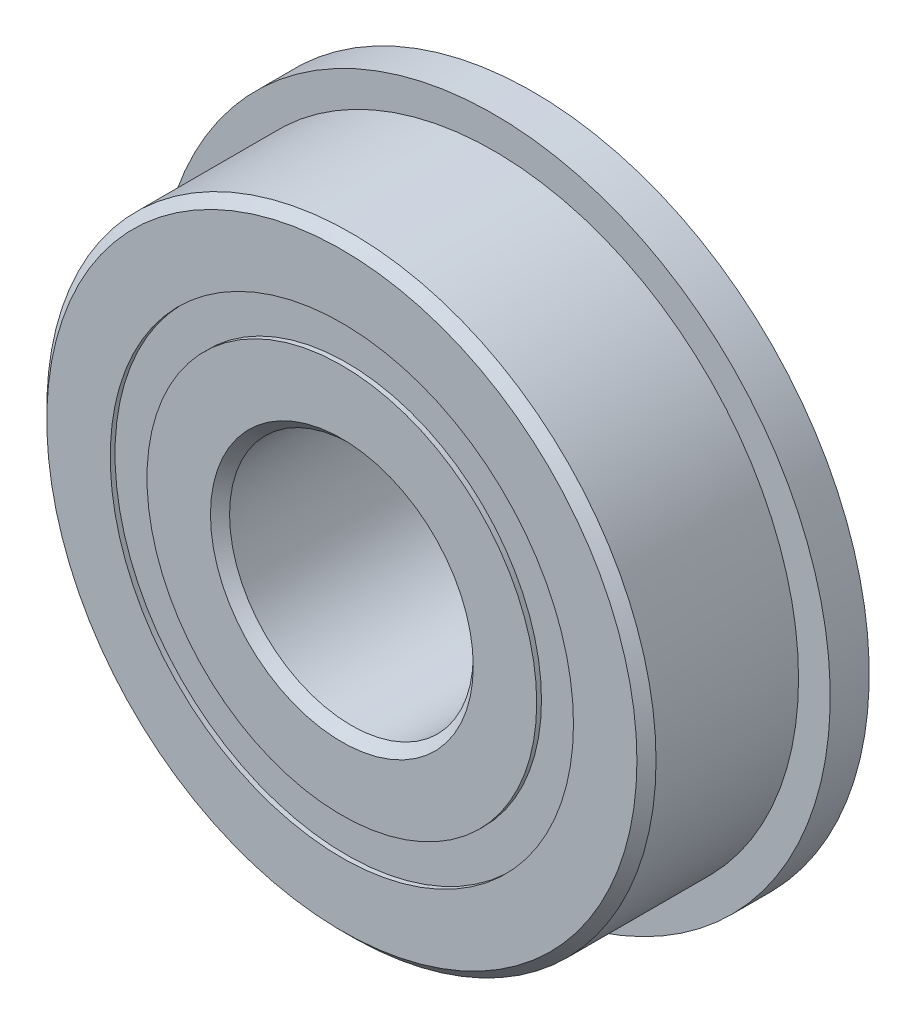
ISO-10303-21;
HEADER;
FILE_DESCRIPTION(('STEP AP214'),'2;1');
FILE_NAME('part.step','',(''),(''),'','','');
FILE_SCHEMA(('AUTOMOTIVE_DESIGN { 1 0 10303 214 1 1 1 1 }'));
ENDSEC;
DATA;
#1=APPLICATION_CONTEXT('core data for automotive mechanical design processes');
#2=APPLICATION_PROTOCOL_DEFINITION('international standard','automotive_design',2000,#1);
#3=PRODUCT_CONTEXT('',#1,'mechanical');
#4=PRODUCT('Part','Part','',(#3));
#5=PRODUCT_RELATED_PRODUCT_CATEGORY('part','',(#4));
#6=PRODUCT_DEFINITION_FORMATION('','',#4);
#7=PRODUCT_DEFINITION_CONTEXT('part definition',#1,'design');
#8=PRODUCT_DEFINITION('design','',#6,#7);
#9=PRODUCT_DEFINITION_SHAPE('','',#8);
#10=(LENGTH_UNIT() NAMED_UNIT(*) SI_UNIT(.MILLI.,.METRE.));
#11=(NAMED_UNIT(*) PLANE_ANGLE_UNIT() SI_UNIT($,.RADIAN.));
#12=(NAMED_UNIT(*) SI_UNIT($,.STERADIAN.) SOLID_ANGLE_UNIT());
#13=UNCERTAINTY_MEASURE_WITH_UNIT(LENGTH_MEASURE(1.E-05),#10,'distance_accuracy_value','');
#14=(GEOMETRIC_REPRESENTATION_CONTEXT(3) GLOBAL_UNCERTAINTY_ASSIGNED_CONTEXT((#13)) GLOBAL_UNIT_ASSIGNED_CONTEXT((#10,
#11,#12)) REPRESENTATION_CONTEXT('',''));
#15=CARTESIAN_POINT('',(0.,0.,0.));
#16=DIRECTION('',(0.,0.,1.));
#17=DIRECTION('',(1.,0.,0.));
#18=AXIS2_PLACEMENT_3D('',#15,#16,#17);
#19=CARTESIAN_POINT('',(0.,6.03522142857143,-2.36474));
#20=DIRECTION('',(0.,0.,1.));
#21=DIRECTION('',(1.,0.,0.));
#22=AXIS2_PLACEMENT_3D('',#19,#20,#21);
#23=PLANE('',#22);
#24=CARTESIAN_POINT('',(0.,0.,-2.36474));
#25=DIRECTION('',(0.,0.,1.));
#26=DIRECTION('',(1.,0.,0.));
#27=AXIS2_PLACEMENT_3D('',#24,#25,#26);
#28=CIRCLE('',#27,6.03522142857143);
#29=CARTESIAN_POINT('',(6.03522142857143,0.,-2.36474));
#30=VERTEX_POINT('',#29);
#31=EDGE_CURVE('E55',#30,#30,#28,.T.);
#32=ORIENTED_EDGE('',*,*,#31,.F.);
#33=EDGE_LOOP('',(#32));
#34=FACE_BOUND('',#33,.T.);
#35=CARTESIAN_POINT('',(0.,0.,-2.36474));
#36=DIRECTION('',(0.,0.,1.));
#37=DIRECTION('',(1.,0.,0.));
#38=AXIS2_PLACEMENT_3D('',#35,#36,#37);
#39=CIRCLE('',#38,5.07727857142857);
#40=CARTESIAN_POINT('',(5.07727857142857,0.,-2.36474));
#41=VERTEX_POINT('',#40);
#42=EDGE_CURVE('E11',#41,#41,#39,.T.);
#43=ORIENTED_EDGE('',*,*,#42,.T.);
#44=EDGE_LOOP('',(#43));
#45=FACE_BOUND('',#44,.T.);
#46=ADVANCED_FACE('F41',(#34,#45),#23,.F.);
#47=CARTESIAN_POINT('',(0.,0.,2.4892));
#48=DIRECTION('',(0.,0.,1.));
#49=DIRECTION('',(1.,0.,0.));
#50=AXIS2_PLACEMENT_3D('',#47,#48,#49);
#51=CYLINDRICAL_SURFACE('',#50,5.07727857142857);
#52=ORIENTED_EDGE('',*,*,#42,.F.);
#53=EDGE_LOOP('',(#52));
#54=FACE_BOUND('',#53,.T.);
#55=CARTESIAN_POINT('',(0.,0.,-1.20554465033679));
#56=DIRECTION('',(0.,0.,1.));
#57=DIRECTION('',(1.,0.,0.));
#58=AXIS2_PLACEMENT_3D('',#55,#56,#57);
#59=CIRCLE('',#58,5.07727857142857);
#60=CARTESIAN_POINT('',(5.07727857142857,0.,-1.20554465033679));
#61=VERTEX_POINT('',#60);
#62=EDGE_CURVE('E47',#61,#61,#59,.T.);
#63=ORIENTED_EDGE('',*,*,#62,.T.);
#64=EDGE_LOOP('',(#63));
#65=FACE_BOUND('',#64,.T.);
#66=ADVANCED_FACE('F64',(#54,#65),#51,.F.);
#67=CARTESIAN_POINT('',(0.,6.03522142857143,-1.20554465033679));
#68=DIRECTION('',(0.,0.,-1.));
#69=DIRECTION('',(-1.,0.,0.));
#70=AXIS2_PLACEMENT_3D('',#67,#68,#69);
#71=PLANE('',#70);
#72=ORIENTED_EDGE('',*,*,#62,.F.);
#73=EDGE_LOOP('',(#72));
#74=FACE_BOUND('',#73,.T.);
#75=CARTESIAN_POINT('',(0.,0.,-1.20554465033679));
#76=DIRECTION('',(0.,0.,1.));
#77=DIRECTION('',(1.,0.,0.));
#78=AXIS2_PLACEMENT_3D('',#75,#76,#77);
#79=CIRCLE('',#78,6.03522142857143);
#80=CARTESIAN_POINT('',(6.03522142857143,0.,-1.20554465033679));
#81=VERTEX_POINT('',#80);
#82=EDGE_CURVE('E51',#81,#81,#79,.T.);
#83=ORIENTED_EDGE('',*,*,#82,.T.);
#84=EDGE_LOOP('',(#83));
#85=FACE_BOUND('',#84,.T.);
#86=ADVANCED_FACE('F68',(#74,#85),#71,.F.);
#87=CARTESIAN_POINT('',(0.,0.,2.4892));
#88=DIRECTION('',(0.,0.,1.));
#89=DIRECTION('',(1.,0.,0.));
#90=AXIS2_PLACEMENT_3D('',#87,#88,#89);
#91=CYLINDRICAL_SURFACE('',#90,6.03522142857143);
#92=ORIENTED_EDGE('',*,*,#82,.F.);
#93=EDGE_LOOP('',(#92));
#94=FACE_BOUND('',#93,.T.);
#95=ORIENTED_EDGE('',*,*,#31,.T.);
#96=EDGE_LOOP('',(#95));
#97=FACE_BOUND('',#96,.T.);
#98=ADVANCED_FACE('F61',(#94,#97),#91,.T.);
#99=CLOSED_SHELL('',(#46,#66,#86,#98));
#100=MANIFOLD_SOLID_BREP('B2',#99);
#101=CARTESIAN_POINT('',(0.,6.03522142857143,2.36474));
#102=DIRECTION('',(0.,0.,-1.));
#103=DIRECTION('',(-1.,0.,0.));
#104=AXIS2_PLACEMENT_3D('',#101,#102,#103);
#105=PLANE('',#104);
#106=CARTESIAN_POINT('',(0.,0.,2.36474));
#107=DIRECTION('',(0.,0.,1.));
#108=DIRECTION('',(1.,0.,0.));
#109=AXIS2_PLACEMENT_3D('',#106,#107,#108);
#110=CIRCLE('',#109,5.07727857142857);
#111=CARTESIAN_POINT('',(5.07727857142857,0.,2.36474));
#112=VERTEX_POINT('',#111);
#113=EDGE_CURVE('E40',#112,#112,#110,.T.);
#114=ORIENTED_EDGE('',*,*,#113,.F.);
#115=EDGE_LOOP('',(#114));
#116=FACE_BOUND('',#115,.T.);
#117=CARTESIAN_POINT('',(0.,0.,2.36474));
#118=DIRECTION('',(0.,0.,1.));
#119=DIRECTION('',(1.,0.,0.));
#120=AXIS2_PLACEMENT_3D('',#117,#118,#119);
#121=CIRCLE('',#120,6.03522142857143);
#122=CARTESIAN_POINT('',(6.03522142857143,0.,2.36474));
#123=VERTEX_POINT('',#122);
#124=EDGE_CURVE('E122',#123,#123,#121,.T.);
#125=ORIENTED_EDGE('',*,*,#124,.T.);
#126=EDGE_LOOP('',(#125));
#127=FACE_BOUND('',#126,.T.);
#128=ADVANCED_FACE('F108',(#116,#127),#105,.F.);
#129=CARTESIAN_POINT('',(0.,0.,2.4892));
#130=DIRECTION('',(0.,0.,1.));
#131=DIRECTION('',(1.,0.,0.));
#132=AXIS2_PLACEMENT_3D('',#129,#130,#131);
#133=CYLINDRICAL_SURFACE('',#132,5.07727857142857);
#134=CARTESIAN_POINT('',(0.,0.,1.20554465033679));
#135=DIRECTION('',(0.,0.,1.));
#136=DIRECTION('',(1.,0.,0.));
#137=AXIS2_PLACEMENT_3D('',#134,#135,#136);
#138=CIRCLE('',#137,5.07727857142857);
#139=CARTESIAN_POINT('',(5.07727857142857,0.,1.20554465033679));
#140=VERTEX_POINT('',#139);
#141=EDGE_CURVE('E114',#140,#140,#138,.T.);
#142=ORIENTED_EDGE('',*,*,#141,.F.);
#143=EDGE_LOOP('',(#142));
#144=FACE_BOUND('',#143,.T.);
#145=ORIENTED_EDGE('',*,*,#113,.T.);
#146=EDGE_LOOP('',(#145));
#147=FACE_BOUND('',#146,.T.);
#148=ADVANCED_FACE('F137',(#144,#147),#133,.F.);
#149=CARTESIAN_POINT('',(0.,6.03522142857143,1.20554465033679));
#150=DIRECTION('',(0.,0.,1.));
#151=DIRECTION('',(1.,0.,0.));
#152=AXIS2_PLACEMENT_3D('',#149,#150,#151);
#153=PLANE('',#152);
#154=CARTESIAN_POINT('',(0.,0.,1.20554465033679));
#155=DIRECTION('',(0.,0.,1.));
#156=DIRECTION('',(1.,0.,0.));
#157=AXIS2_PLACEMENT_3D('',#154,#155,#156);
#158=CIRCLE('',#157,6.03522142857143);
#159=CARTESIAN_POINT('',(6.03522142857143,0.,1.20554465033679));
#160=VERTEX_POINT('',#159);
#161=EDGE_CURVE('E118',#160,#160,#158,.T.);
#162=ORIENTED_EDGE('',*,*,#161,.F.);
#163=EDGE_LOOP('',(#162));
#164=FACE_BOUND('',#163,.T.);
#165=ORIENTED_EDGE('',*,*,#141,.T.);
#166=EDGE_LOOP('',(#165));
#167=FACE_BOUND('',#166,.T.);
#168=ADVANCED_FACE('F132',(#164,#167),#153,.F.);
#169=CARTESIAN_POINT('',(0.,0.,2.4892));
#170=DIRECTION('',(0.,0.,1.));
#171=DIRECTION('',(1.,0.,0.));
#172=AXIS2_PLACEMENT_3D('',#169,#170,#171);
#173=CYLINDRICAL_SURFACE('',#172,6.03522142857143);
#174=ORIENTED_EDGE('',*,*,#124,.F.);
#175=EDGE_LOOP('',(#174));
#176=FACE_BOUND('',#175,.T.);
#177=ORIENTED_EDGE('',*,*,#161,.T.);
#178=EDGE_LOOP('',(#177));
#179=FACE_BOUND('',#178,.T.);
#180=ADVANCED_FACE('F129',(#176,#179),#173,.T.);
#181=CLOSED_SHELL('',(#128,#148,#168,#180));
#182=MANIFOLD_SOLID_BREP('B6',#181);
#183=CARTESIAN_POINT('',(-2.41076652547187,5.00600827228285,0.));
#184=DIRECTION('',(0.,0.,1.));
#185=DIRECTION('',(-0.433883739117546,0.900968867902425,0.));
#186=AXIS2_PLACEMENT_3D('',#183,#184,#185);
#187=SPHERICAL_SURFACE('',#186,1.20554465033679);
#188=CARTESIAN_POINT('',(-2.41076652547187,5.00600827228285,1.20554465033679));
#189=VERTEX_POINT('',#188);
#190=VERTEX_LOOP('',#189);
#191=FACE_BOUND('',#190,.T.);
#192=ADVANCED_FACE('F175',(#191),#187,.T.);
#193=CLOSED_SHELL('',(#192));
#194=MANIFOLD_SOLID_BREP('B35',#193);
#195=CARTESIAN_POINT('',(-4.34405117446295,3.46426521157764,0.));
#196=DIRECTION('',(0.,0.,1.));
#197=DIRECTION('',(-0.781831482468022,0.623489801858743,0.));
#198=AXIS2_PLACEMENT_3D('',#195,#196,#197);
#199=SPHERICAL_SURFACE('',#198,1.20554465033679);
#200=CARTESIAN_POINT('',(-4.34405117446295,3.46426521157764,1.20554465033679));
#201=VERTEX_POINT('',#200);
#202=VERTEX_LOOP('',#201);
#203=FACE_BOUND('',#202,.T.);
#204=ADVANCED_FACE('F195',(#203),#199,.T.);
#205=CLOSED_SHELL('',(#204));
#206=MANIFOLD_SOLID_BREP('B104',#205);
#207=CARTESIAN_POINT('',(-5.41694321206024,1.23638193929483,0.));
#208=DIRECTION('',(0.,0.,1.));
#209=DIRECTION('',(-0.974927912181821,0.222520933956325,0.));
#210=AXIS2_PLACEMENT_3D('',#207,#208,#209);
#211=SPHERICAL_SURFACE('',#210,1.20554465033679);
#212=CARTESIAN_POINT('',(-5.41694321206024,1.23638193929483,1.20554465033679));
#213=VERTEX_POINT('',#212);
#214=VERTEX_LOOP('',#213);
#215=FACE_BOUND('',#214,.T.);
#216=ADVANCED_FACE('F215',(#215),#211,.T.);
#217=CLOSED_SHELL('',(#216));
#218=MANIFOLD_SOLID_BREP('B171',#217);
#219=CARTESIAN_POINT('',(-5.41694321206027,-1.23638193929472,0.));
#220=DIRECTION('',(0.,0.,1.));
#221=DIRECTION('',(-0.974927912181826,-0.222520933956305,0.));
#222=AXIS2_PLACEMENT_3D('',#219,#220,#221);
#223=SPHERICAL_SURFACE('',#222,1.20554465033679);
#224=CARTESIAN_POINT('',(-5.41694321206027,-1.23638193929472,1.20554465033679));
#225=VERTEX_POINT('',#224);
#226=VERTEX_LOOP('',#225);
#227=FACE_BOUND('',#226,.T.);
#228=ADVANCED_FACE('F235',(#227),#223,.T.);
#229=CLOSED_SHELL('',(#228));
#230=MANIFOLD_SOLID_BREP('B191',#229);
#231=CARTESIAN_POINT('',(-4.34405117446302,-3.46426521157755,0.));
#232=DIRECTION('',(0.,0.,1.));
#233=DIRECTION('',(-0.781831482468035,-0.623489801858727,0.));
#234=AXIS2_PLACEMENT_3D('',#231,#232,#233);
#235=SPHERICAL_SURFACE('',#234,1.20554465033679);
#236=CARTESIAN_POINT('',(-4.34405117446302,-3.46426521157755,1.20554465033679));
#237=VERTEX_POINT('',#236);
#238=VERTEX_LOOP('',#237);
#239=FACE_BOUND('',#238,.T.);
#240=ADVANCED_FACE('F255',(#239),#235,.T.);
#241=CLOSED_SHELL('',(#240));
#242=MANIFOLD_SOLID_BREP('B211',#241);
#243=CARTESIAN_POINT('',(-2.41076652547197,-5.0060082722828,0.));
#244=DIRECTION('',(0.,0.,1.));
#245=DIRECTION('',(-0.433883739117565,-0.900968867902416,0.));
#246=AXIS2_PLACEMENT_3D('',#243,#244,#245);
#247=SPHERICAL_SURFACE('',#246,1.20554465033679);
#248=CARTESIAN_POINT('',(-2.41076652547197,-5.0060082722828,1.20554465033679));
#249=VERTEX_POINT('',#248);
#250=VERTEX_LOOP('',#249);
#251=FACE_BOUND('',#250,.T.);
#252=ADVANCED_FACE('F275',(#251),#247,.T.);
#253=CLOSED_SHELL('',(#252));
#254=MANIFOLD_SOLID_BREP('B231',#253);
#255=CARTESIAN_POINT('',(0.,-5.55625,0.));
#256=DIRECTION('',(0.,0.,1.));
#257=DIRECTION('',(0.,-1.,0.));
#258=AXIS2_PLACEMENT_3D('',#255,#256,#257);
#259=SPHERICAL_SURFACE('',#258,1.20554465033679);
#260=CARTESIAN_POINT('',(0.,-5.55625,1.20554465033679));
#261=VERTEX_POINT('',#260);
#262=VERTEX_LOOP('',#261);
#263=FACE_BOUND('',#262,.T.);
#264=ADVANCED_FACE('F295',(#263),#259,.T.);
#265=CLOSED_SHELL('',(#264));
#266=MANIFOLD_SOLID_BREP('B251',#265);
#267=CARTESIAN_POINT('',(2.4107665254719,-5.00600827228283,0.));
#268=DIRECTION('',(0.,0.,1.));
#269=DIRECTION('',(0.433883739117553,-0.900968867902422,0.));
#270=AXIS2_PLACEMENT_3D('',#267,#268,#269);
#271=SPHERICAL_SURFACE('',#270,1.20554465033679);
#272=CARTESIAN_POINT('',(2.4107665254719,-5.00600827228283,1.20554465033679));
#273=VERTEX_POINT('',#272);
#274=VERTEX_LOOP('',#273);
#275=FACE_BOUND('',#274,.T.);
#276=ADVANCED_FACE('F315',(#275),#271,.T.);
#277=CLOSED_SHELL('',(#276));
#278=MANIFOLD_SOLID_BREP('B271',#277);
#279=CARTESIAN_POINT('',(4.34405117446297,-3.46426521157761,0.));
#280=DIRECTION('',(0.,0.,1.));
#281=DIRECTION('',(0.781831482468027,-0.623489801858737,0.));
#282=AXIS2_PLACEMENT_3D('',#279,#280,#281);
#283=SPHERICAL_SURFACE('',#282,1.20554465033679);
#284=CARTESIAN_POINT('',(4.34405117446297,-3.46426521157761,1.20554465033679));
#285=VERTEX_POINT('',#284);
#286=VERTEX_LOOP('',#285);
#287=FACE_BOUND('',#286,.T.);
#288=ADVANCED_FACE('F335',(#287),#283,.T.);
#289=CLOSED_SHELL('',(#288));
#290=MANIFOLD_SOLID_BREP('B291',#289);
#291=CARTESIAN_POINT('',(5.41694321206025,-1.23638193929479,0.));
#292=DIRECTION('',(0.,0.,1.));
#293=DIRECTION('',(0.974927912181823,-0.222520933956318,0.));
#294=AXIS2_PLACEMENT_3D('',#291,#292,#293);
#295=SPHERICAL_SURFACE('',#294,1.20554465033679);
#296=CARTESIAN_POINT('',(5.41694321206025,-1.23638193929479,1.20554465033679));
#297=VERTEX_POINT('',#296);
#298=VERTEX_LOOP('',#297);
#299=FACE_BOUND('',#298,.T.);
#300=ADVANCED_FACE('F355',(#299),#295,.T.);
#301=CLOSED_SHELL('',(#300));
#302=MANIFOLD_SOLID_BREP('B311',#301);
#303=CARTESIAN_POINT('',(5.41694321206026,1.23638193929476,0.));
#304=DIRECTION('',(0.,0.,1.));
#305=DIRECTION('',(0.974927912181824,0.222520933956311,0.));
#306=AXIS2_PLACEMENT_3D('',#303,#304,#305);
#307=SPHERICAL_SURFACE('',#306,1.20554465033679);
#308=CARTESIAN_POINT('',(5.41694321206026,1.23638193929476,1.20554465033679));
#309=VERTEX_POINT('',#308);
#310=VERTEX_LOOP('',#309);
#311=FACE_BOUND('',#310,.T.);
#312=ADVANCED_FACE('F375',(#311),#307,.T.);
#313=CLOSED_SHELL('',(#312));
#314=MANIFOLD_SOLID_BREP('B331',#313);
#315=CARTESIAN_POINT('',(4.344051174463,3.46426521157758,0.));
#316=DIRECTION('',(0.,0.,1.));
#317=DIRECTION('',(0.781831482468031,0.623489801858732,0.));
#318=AXIS2_PLACEMENT_3D('',#315,#316,#317);
#319=SPHERICAL_SURFACE('',#318,1.20554465033679);
#320=CARTESIAN_POINT('',(4.344051174463,3.46426521157758,1.20554465033679));
#321=VERTEX_POINT('',#320);
#322=VERTEX_LOOP('',#321);
#323=FACE_BOUND('',#322,.T.);
#324=ADVANCED_FACE('F395',(#323),#319,.T.);
#325=CLOSED_SHELL('',(#324));
#326=MANIFOLD_SOLID_BREP('B351',#325);
#327=CARTESIAN_POINT('',(2.41076652547194,5.00600827228281,0.));
#328=DIRECTION('',(0.,0.,1.));
#329=DIRECTION('',(0.433883739117559,0.900968867902419,0.));
#330=AXIS2_PLACEMENT_3D('',#327,#328,#329);
#331=SPHERICAL_SURFACE('',#330,1.20554465033679);
#332=CARTESIAN_POINT('',(2.41076652547194,5.00600827228281,1.20554465033679));
#333=VERTEX_POINT('',#332);
#334=VERTEX_LOOP('',#333);
#335=FACE_BOUND('',#334,.T.);
#336=ADVANCED_FACE('F415',(#335),#331,.T.);
#337=CLOSED_SHELL('',(#336));
#338=MANIFOLD_SOLID_BREP('B371',#337);
#339=CARTESIAN_POINT('',(0.,5.55625,0.));
#340=DIRECTION('',(0.,0.,1.));
#341=DIRECTION('',(0.,1.,0.));
#342=AXIS2_PLACEMENT_3D('',#339,#340,#341);
#343=SPHERICAL_SURFACE('',#342,1.20554465033679);
#344=CARTESIAN_POINT('',(0.,5.55625,1.20554465033679));
#345=VERTEX_POINT('',#344);
#346=VERTEX_LOOP('',#345);
#347=FACE_BOUND('',#346,.T.);
#348=ADVANCED_FACE('F437',(#347),#343,.T.);
#349=CLOSED_SHELL('',(#348));
#350=MANIFOLD_SOLID_BREP('B391',#349);
#351=CARTESIAN_POINT('',(0.,5.07727857142857,2.4892));
#352=DIRECTION('',(0.,0.,-1.));
#353=DIRECTION('',(-1.,0.,0.));
#354=AXIS2_PLACEMENT_3D('',#351,#352,#353);
#355=PLANE('',#354);
#356=CARTESIAN_POINT('',(0.,0.,2.4892));
#357=DIRECTION('',(0.,0.,1.));
#358=DIRECTION('',(1.,0.,0.));
#359=AXIS2_PLACEMENT_3D('',#356,#357,#358);
#360=CIRCLE('',#359,3.42392);
#361=CARTESIAN_POINT('',(3.42392,0.,2.4892));
#362=VERTEX_POINT('',#361);
#363=EDGE_CURVE('E484',#362,#362,#360,.T.);
#364=ORIENTED_EDGE('',*,*,#363,.F.);
#365=EDGE_LOOP('',(#364));
#366=FACE_BOUND('',#365,.T.);
#367=CARTESIAN_POINT('',(0.,0.,2.4892));
#368=DIRECTION('',(0.,0.,1.));
#369=DIRECTION('',(1.,0.,0.));
#370=AXIS2_PLACEMENT_3D('',#367,#368,#369);
#371=CIRCLE('',#370,5.07727857142857);
#372=CARTESIAN_POINT('',(5.07727857142857,0.,2.4892));
#373=VERTEX_POINT('',#372);
#374=EDGE_CURVE('E436',#373,#373,#371,.T.);
#375=ORIENTED_EDGE('',*,*,#374,.T.);
#376=EDGE_LOOP('',(#375));
#377=FACE_BOUND('',#376,.T.);
#378=ADVANCED_FACE('F456',(#366,#377),#355,.F.);
#379=CARTESIAN_POINT('',(0.,0.,2.4892));
#380=DIRECTION('',(0.,0.,1.));
#381=DIRECTION('',(1.,0.,0.));
#382=AXIS2_PLACEMENT_3D('',#379,#380,#381);
#383=CYLINDRICAL_SURFACE('',#382,5.07727857142857);
#384=ORIENTED_EDGE('',*,*,#374,.F.);
#385=EDGE_LOOP('',(#384));
#386=FACE_BOUND('',#385,.T.);
#387=CARTESIAN_POINT('',(0.,0.,1.10631111111111));
#388=DIRECTION('',(0.,0.,1.));
#389=DIRECTION('',(1.,0.,0.));
#390=AXIS2_PLACEMENT_3D('',#387,#388,#389);
#391=CIRCLE('',#390,5.07727857142857);
#392=CARTESIAN_POINT('',(5.07727857142857,0.,1.10631111111111));
#393=VERTEX_POINT('',#392);
#394=EDGE_CURVE('E462',#393,#393,#391,.T.);
#395=ORIENTED_EDGE('',*,*,#394,.T.);
#396=EDGE_LOOP('',(#395));
#397=FACE_BOUND('',#396,.T.);
#398=ADVANCED_FACE('F491',(#386,#397),#383,.T.);
#399=CARTESIAN_POINT('',(0.,0.,0.));
#400=DIRECTION('',(0.,0.,1.));
#401=DIRECTION('',(1.,0.,0.));
#402=AXIS2_PLACEMENT_3D('',#399,#400,#401);
#403=TOROIDAL_SURFACE('',#402,5.55625,1.20554465033679);
#404=ORIENTED_EDGE('',*,*,#394,.F.);
#405=EDGE_LOOP('',(#404));
#406=FACE_BOUND('',#405,.T.);
#407=CARTESIAN_POINT('',(0.,0.,-1.10631111111111));
#408=DIRECTION('',(0.,0.,1.));
#409=DIRECTION('',(1.,0.,0.));
#410=AXIS2_PLACEMENT_3D('',#407,#408,#409);
#411=CIRCLE('',#410,5.07727857142857);
#412=CARTESIAN_POINT('',(5.07727857142857,0.,-1.10631111111111));
#413=VERTEX_POINT('',#412);
#414=EDGE_CURVE('E466',#413,#413,#411,.T.);
#415=ORIENTED_EDGE('',*,*,#414,.T.);
#416=EDGE_LOOP('',(#415));
#417=FACE_BOUND('',#416,.T.);
#418=ADVANCED_FACE('F495',(#406,#417),#403,.F.);
#419=CARTESIAN_POINT('',(0.,0.,2.4892));
#420=DIRECTION('',(0.,0.,1.));
#421=DIRECTION('',(1.,0.,0.));
#422=AXIS2_PLACEMENT_3D('',#419,#420,#421);
#423=CYLINDRICAL_SURFACE('',#422,5.07727857142857);
#424=ORIENTED_EDGE('',*,*,#414,.F.);
#425=EDGE_LOOP('',(#424));
#426=FACE_BOUND('',#425,.T.);
#427=CARTESIAN_POINT('',(0.,0.,-2.4892));
#428=DIRECTION('',(0.,0.,1.));
#429=DIRECTION('',(1.,0.,0.));
#430=AXIS2_PLACEMENT_3D('',#427,#428,#429);
#431=CIRCLE('',#430,5.07727857142857);
#432=CARTESIAN_POINT('',(5.07727857142857,0.,-2.4892));
#433=VERTEX_POINT('',#432);
#434=EDGE_CURVE('E470',#433,#433,#431,.T.);
#435=ORIENTED_EDGE('',*,*,#434,.T.);
#436=EDGE_LOOP('',(#435));
#437=FACE_BOUND('',#436,.T.);
#438=ADVANCED_FACE('F500',(#426,#437),#423,.T.);
#439=CARTESIAN_POINT('',(0.,3.42392,-2.4892));
#440=DIRECTION('',(0.,0.,1.));
#441=DIRECTION('',(1.,0.,0.));
#442=AXIS2_PLACEMENT_3D('',#439,#440,#441);
#443=PLANE('',#442);
#444=ORIENTED_EDGE('',*,*,#434,.F.);
#445=EDGE_LOOP('',(#444));
#446=FACE_BOUND('',#445,.T.);
#447=CARTESIAN_POINT('',(0.,0.,-2.4892));
#448=DIRECTION('',(0.,0.,1.));
#449=DIRECTION('',(1.,0.,0.));
#450=AXIS2_PLACEMENT_3D('',#447,#448,#449);
#451=CIRCLE('',#450,3.42392);
#452=CARTESIAN_POINT('',(3.42392,0.,-2.4892));
#453=VERTEX_POINT('',#452);
#454=EDGE_CURVE('E475',#453,#453,#451,.T.);
#455=ORIENTED_EDGE('',*,*,#454,.T.);
#456=EDGE_LOOP('',(#455));
#457=FACE_BOUND('',#456,.T.);
#458=ADVANCED_FACE('F506',(#446,#457),#443,.F.);
#459=CARTESIAN_POINT('',(0.,0.,-2.24028));
#460=DIRECTION('',(0.,0.,-1.));
#461=DIRECTION('',(-1.,0.,0.));
#462=AXIS2_PLACEMENT_3D('',#459,#460,#461);
#463=CONICAL_SURFACE('',#462,3.175,0.785398163397445);
#464=ORIENTED_EDGE('',*,*,#454,.F.);
#465=EDGE_LOOP('',(#464));
#466=FACE_BOUND('',#465,.T.);
#467=CARTESIAN_POINT('',(0.,0.,-2.24028));
#468=DIRECTION('',(0.,0.,1.));
#469=DIRECTION('',(1.,0.,0.));
#470=AXIS2_PLACEMENT_3D('',#467,#468,#469);
#471=CIRCLE('',#470,3.175);
#472=CARTESIAN_POINT('',(3.175,0.,-2.24028));
#473=VERTEX_POINT('',#472);
#474=EDGE_CURVE('E478',#473,#473,#471,.T.);
#475=ORIENTED_EDGE('',*,*,#474,.T.);
#476=EDGE_LOOP('',(#475));
#477=FACE_BOUND('',#476,.T.);
#478=ADVANCED_FACE('F510',(#466,#477),#463,.F.);
#479=CARTESIAN_POINT('',(0.,0.,2.4892));
#480=DIRECTION('',(0.,0.,1.));
#481=DIRECTION('',(1.,0.,0.));
#482=AXIS2_PLACEMENT_3D('',#479,#480,#481);
#483=CYLINDRICAL_SURFACE('',#482,3.175);
#484=ORIENTED_EDGE('',*,*,#474,.F.);
#485=EDGE_LOOP('',(#484));
#486=FACE_BOUND('',#485,.T.);
#487=CARTESIAN_POINT('',(0.,0.,2.24028));
#488=DIRECTION('',(0.,0.,1.));
#489=DIRECTION('',(1.,0.,0.));
#490=AXIS2_PLACEMENT_3D('',#487,#488,#489);
#491=CIRCLE('',#490,3.175);
#492=CARTESIAN_POINT('',(3.175,0.,2.24028));
#493=VERTEX_POINT('',#492);
#494=EDGE_CURVE('E481',#493,#493,#491,.T.);
#495=ORIENTED_EDGE('',*,*,#494,.T.);
#496=EDGE_LOOP('',(#495));
#497=FACE_BOUND('',#496,.T.);
#498=ADVANCED_FACE('F514',(#486,#497),#483,.F.);
#499=CARTESIAN_POINT('',(0.,0.,2.4892));
#500=DIRECTION('',(0.,0.,1.));
#501=DIRECTION('',(1.,0.,0.));
#502=AXIS2_PLACEMENT_3D('',#499,#500,#501);
#503=CONICAL_SURFACE('',#502,3.42392,0.785398163397452);
#504=ORIENTED_EDGE('',*,*,#494,.F.);
#505=EDGE_LOOP('',(#504));
#506=FACE_BOUND('',#505,.T.);
#507=ORIENTED_EDGE('',*,*,#363,.T.);
#508=EDGE_LOOP('',(#507));
#509=FACE_BOUND('',#508,.T.);
#510=ADVANCED_FACE('F488',(#506,#509),#503,.F.);
#511=CLOSED_SHELL('',(#378,#398,#418,#438,#458,#478,#498,#510));
#512=MANIFOLD_SOLID_BREP('B411',#511);
#513=CARTESIAN_POINT('',(0.,0.,2.24028));
#514=DIRECTION('',(0.,0.,-1.));
#515=DIRECTION('',(-1.,0.,0.));
#516=AXIS2_PLACEMENT_3D('',#513,#514,#515);
#517=CONICAL_SURFACE('',#516,7.9375,0.785398163397447);
#518=CARTESIAN_POINT('',(0.,0.,2.4892));
#519=DIRECTION('',(0.,0.,1.));
#520=DIRECTION('',(1.,0.,0.));
#521=AXIS2_PLACEMENT_3D('',#518,#519,#520);
#522=CIRCLE('',#521,7.68858);
#523=CARTESIAN_POINT('',(7.68858,0.,2.4892));
#524=VERTEX_POINT('',#523);
#525=EDGE_CURVE('E599',#524,#524,#522,.T.);
#526=ORIENTED_EDGE('',*,*,#525,.F.);
#527=EDGE_LOOP('',(#526));
#528=FACE_BOUND('',#527,.T.);
#529=CARTESIAN_POINT('',(0.,0.,2.24028));
#530=DIRECTION('',(0.,0.,1.));
#531=DIRECTION('',(1.,0.,0.));
#532=AXIS2_PLACEMENT_3D('',#529,#530,#531);
#533=CIRCLE('',#532,7.9375);
#534=CARTESIAN_POINT('',(7.9375,0.,2.24028));
#535=VERTEX_POINT('',#534);
#536=EDGE_CURVE('E455',#535,#535,#533,.T.);
#537=ORIENTED_EDGE('',*,*,#536,.T.);
#538=EDGE_LOOP('',(#537));
#539=FACE_BOUND('',#538,.T.);
#540=ADVANCED_FACE('F577',(#528,#539),#517,.T.);
#541=CARTESIAN_POINT('',(0.,0.,2.4892));
#542=DIRECTION('',(0.,0.,1.));
#543=DIRECTION('',(1.,0.,0.));
#544=AXIS2_PLACEMENT_3D('',#541,#542,#543);
#545=CYLINDRICAL_SURFACE('',#544,7.9375);
#546=CARTESIAN_POINT('',(0.,0.,-1.4732));
#547=DIRECTION('',(0.,0.,1.));
#548=DIRECTION('',(1.,0.,0.));
#549=AXIS2_PLACEMENT_3D('',#546,#547,#548);
#550=CIRCLE('',#549,7.9375);
#551=CARTESIAN_POINT('',(7.9375,0.,-1.4732));
#552=VERTEX_POINT('',#551);
#553=EDGE_CURVE('E602',#552,#552,#550,.T.);
#554=ORIENTED_EDGE('',*,*,#553,.T.);
#555=EDGE_LOOP('',(#554));
#556=FACE_BOUND('',#555,.T.);
#557=ORIENTED_EDGE('',*,*,#536,.F.);
#558=EDGE_LOOP('',(#557));
#559=FACE_BOUND('',#558,.T.);
#560=ADVANCED_FACE('F622',(#556,#559),#545,.T.);
#561=CARTESIAN_POINT('',(0.,7.68858,-2.4892));
#562=DIRECTION('',(0.,0.,1.));
#563=DIRECTION('',(1.,0.,0.));
#564=AXIS2_PLACEMENT_3D('',#561,#562,#563);
#565=PLANE('',#564);
#566=CARTESIAN_POINT('',(0.,0.,-2.4892));
#567=DIRECTION('',(0.,0.,1.));
#568=DIRECTION('',(1.,0.,0.));
#569=AXIS2_PLACEMENT_3D('',#566,#567,#568);
#570=CIRCLE('',#569,6.03522142857143);
#571=CARTESIAN_POINT('',(6.03522142857143,0.,-2.4892));
#572=VERTEX_POINT('',#571);
#573=EDGE_CURVE('E583',#572,#572,#570,.T.);
#574=ORIENTED_EDGE('',*,*,#573,.T.);
#575=EDGE_LOOP('',(#574));
#576=FACE_BOUND('',#575,.T.);
#577=CARTESIAN_POINT('',(0.,0.,-2.4892));
#578=DIRECTION('',(0.,0.,-1.));
#579=DIRECTION('',(-1.,0.,0.));
#580=AXIS2_PLACEMENT_3D('',#577,#578,#579);
#581=CIRCLE('',#580,8.763);
#582=CARTESIAN_POINT('',(-8.763,0.,-2.4892));
#583=VERTEX_POINT('',#582);
#584=EDGE_CURVE('E605',#583,#583,#581,.T.);
#585=ORIENTED_EDGE('',*,*,#584,.T.);
#586=EDGE_LOOP('',(#585));
#587=FACE_BOUND('',#586,.T.);
#588=ADVANCED_FACE('F625',(#576,#587),#565,.F.);
#589=CARTESIAN_POINT('',(0.,0.,2.4892));
#590=DIRECTION('',(0.,0.,1.));
#591=DIRECTION('',(1.,0.,0.));
#592=AXIS2_PLACEMENT_3D('',#589,#590,#591);
#593=CYLINDRICAL_SURFACE('',#592,6.03522142857143);
#594=CARTESIAN_POINT('',(0.,0.,-1.10631111111111));
#595=DIRECTION('',(0.,0.,1.));
#596=DIRECTION('',(1.,0.,0.));
#597=AXIS2_PLACEMENT_3D('',#594,#595,#596);
#598=CIRCLE('',#597,6.03522142857143);
#599=CARTESIAN_POINT('',(6.03522142857143,0.,-1.10631111111111));
#600=VERTEX_POINT('',#599);
#601=EDGE_CURVE('E587',#600,#600,#598,.T.);
#602=ORIENTED_EDGE('',*,*,#601,.T.);
#603=EDGE_LOOP('',(#602));
#604=FACE_BOUND('',#603,.T.);
#605=ORIENTED_EDGE('',*,*,#573,.F.);
#606=EDGE_LOOP('',(#605));
#607=FACE_BOUND('',#606,.T.);
#608=ADVANCED_FACE('F630',(#604,#607),#593,.F.);
#609=CARTESIAN_POINT('',(0.,0.,0.));
#610=DIRECTION('',(0.,0.,1.));
#611=DIRECTION('',(1.,0.,0.));
#612=AXIS2_PLACEMENT_3D('',#609,#610,#611);
#613=TOROIDAL_SURFACE('',#612,5.55625,1.20554465033679);
#614=ORIENTED_EDGE('',*,*,#601,.F.);
#615=EDGE_LOOP('',(#614));
#616=FACE_BOUND('',#615,.T.);
#617=CARTESIAN_POINT('',(0.,0.,1.10631111111111));
#618=DIRECTION('',(0.,0.,1.));
#619=DIRECTION('',(1.,0.,0.));
#620=AXIS2_PLACEMENT_3D('',#617,#618,#619);
#621=CIRCLE('',#620,6.03522142857143);
#622=CARTESIAN_POINT('',(6.03522142857143,0.,1.10631111111111));
#623=VERTEX_POINT('',#622);
#624=EDGE_CURVE('E591',#623,#623,#621,.T.);
#625=ORIENTED_EDGE('',*,*,#624,.T.);
#626=EDGE_LOOP('',(#625));
#627=FACE_BOUND('',#626,.T.);
#628=ADVANCED_FACE('F636',(#616,#627),#613,.F.);
#629=CARTESIAN_POINT('',(0.,0.,2.4892));
#630=DIRECTION('',(0.,0.,1.));
#631=DIRECTION('',(1.,0.,0.));
#632=AXIS2_PLACEMENT_3D('',#629,#630,#631);
#633=CYLINDRICAL_SURFACE('',#632,6.03522142857143);
#634=ORIENTED_EDGE('',*,*,#624,.F.);
#635=EDGE_LOOP('',(#634));
#636=FACE_BOUND('',#635,.T.);
#637=CARTESIAN_POINT('',(0.,0.,2.4892));
#638=DIRECTION('',(0.,0.,1.));
#639=DIRECTION('',(1.,0.,0.));
#640=AXIS2_PLACEMENT_3D('',#637,#638,#639);
#641=CIRCLE('',#640,6.03522142857143);
#642=CARTESIAN_POINT('',(6.03522142857143,0.,2.4892));
#643=VERTEX_POINT('',#642);
#644=EDGE_CURVE('E596',#643,#643,#641,.T.);
#645=ORIENTED_EDGE('',*,*,#644,.T.);
#646=EDGE_LOOP('',(#645));
#647=FACE_BOUND('',#646,.T.);
#648=ADVANCED_FACE('F640',(#636,#647),#633,.F.);
#649=CARTESIAN_POINT('',(0.,7.68858,2.4892));
#650=DIRECTION('',(0.,0.,-1.));
#651=DIRECTION('',(-1.,0.,0.));
#652=AXIS2_PLACEMENT_3D('',#649,#650,#651);
#653=PLANE('',#652);
#654=ORIENTED_EDGE('',*,*,#644,.F.);
#655=EDGE_LOOP('',(#654));
#656=FACE_BOUND('',#655,.T.);
#657=ORIENTED_EDGE('',*,*,#525,.T.);
#658=EDGE_LOOP('',(#657));
#659=FACE_BOUND('',#658,.T.);
#660=ADVANCED_FACE('F618',(#656,#659),#653,.F.);
#661=CARTESIAN_POINT('',(0.,6.03522142857143,-1.4732));
#662=DIRECTION('',(0.,0.,1.));
#663=DIRECTION('',(1.,0.,0.));
#664=AXIS2_PLACEMENT_3D('',#661,#662,#663);
#665=PLANE('',#664);
#666=CARTESIAN_POINT('',(0.,0.,-1.4732));
#667=DIRECTION('',(0.,0.,-1.));
#668=DIRECTION('',(-1.,0.,0.));
#669=AXIS2_PLACEMENT_3D('',#666,#667,#668);
#670=CIRCLE('',#669,8.763);
#671=CARTESIAN_POINT('',(-8.763,0.,-1.4732));
#672=VERTEX_POINT('',#671);
#673=EDGE_CURVE('E608',#672,#672,#670,.T.);
#674=ORIENTED_EDGE('',*,*,#673,.F.);
#675=EDGE_LOOP('',(#674));
#676=FACE_BOUND('',#675,.T.);
#677=ORIENTED_EDGE('',*,*,#553,.F.);
#678=EDGE_LOOP('',(#677));
#679=FACE_BOUND('',#678,.T.);
#680=ADVANCED_FACE('F615',(#676,#679),#665,.T.);
#681=CARTESIAN_POINT('',(0.,0.,-2.4892));
#682=DIRECTION('',(0.,0.,-1.));
#683=DIRECTION('',(-1.,0.,0.));
#684=AXIS2_PLACEMENT_3D('',#681,#682,#683);
#685=CYLINDRICAL_SURFACE('',#684,8.763);
#686=ORIENTED_EDGE('',*,*,#673,.T.);
#687=EDGE_LOOP('',(#686));
#688=FACE_BOUND('',#687,.T.);
#689=ORIENTED_EDGE('',*,*,#584,.F.);
#690=EDGE_LOOP('',(#689));
#691=FACE_BOUND('',#690,.T.);
#692=ADVANCED_FACE('F612',(#688,#691),#685,.T.);
#693=CLOSED_SHELL('',(#540,#560,#588,#608,#628,#648,#660,#680,#692));
#694=MANIFOLD_SOLID_BREP('B431',#693);
#695=ADVANCED_BREP_SHAPE_REPRESENTATION('',(#18,#100,#182,#194,#206,#218,#230,#242,#254,#266,
#278,#290,#302,#314,#326,#338,#350,#512,#694),#14);
#696=SHAPE_DEFINITION_REPRESENTATION(#9,#695);
ENDSEC;
END-ISO-10303-21;
